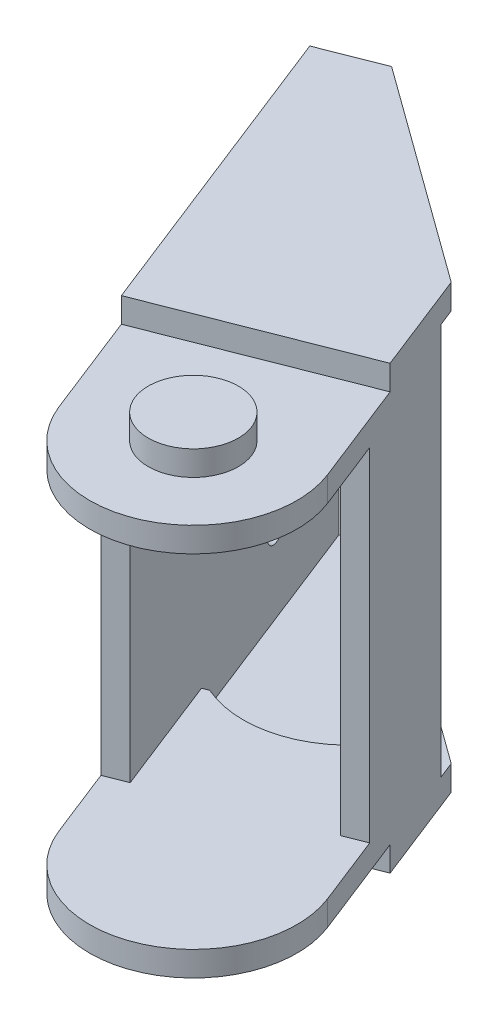
ISO-10303-21;
HEADER;
FILE_DESCRIPTION(('STEP AP214'),'2;1');
FILE_NAME('part.step','',(''),(''),'','','');
FILE_SCHEMA(('AUTOMOTIVE_DESIGN { 1 0 10303 214 1 1 1 1 }'));
ENDSEC;
DATA;
#1=APPLICATION_CONTEXT('core data for automotive mechanical design processes');
#2=APPLICATION_PROTOCOL_DEFINITION('international standard','automotive_design',2000,#1);
#3=PRODUCT_CONTEXT('',#1,'mechanical');
#4=PRODUCT('Part','Part','',(#3));
#5=PRODUCT_RELATED_PRODUCT_CATEGORY('part','',(#4));
#6=PRODUCT_DEFINITION_FORMATION('','',#4);
#7=PRODUCT_DEFINITION_CONTEXT('part definition',#1,'design');
#8=PRODUCT_DEFINITION('design','',#6,#7);
#9=PRODUCT_DEFINITION_SHAPE('','',#8);
#10=(LENGTH_UNIT() NAMED_UNIT(*) SI_UNIT(.MILLI.,.METRE.));
#11=(NAMED_UNIT(*) PLANE_ANGLE_UNIT() SI_UNIT($,.RADIAN.));
#12=(NAMED_UNIT(*) SI_UNIT($,.STERADIAN.) SOLID_ANGLE_UNIT());
#13=UNCERTAINTY_MEASURE_WITH_UNIT(LENGTH_MEASURE(1.E-05),#10,'distance_accuracy_value','');
#14=(GEOMETRIC_REPRESENTATION_CONTEXT(3) GLOBAL_UNCERTAINTY_ASSIGNED_CONTEXT((#13)) GLOBAL_UNIT_ASSIGNED_CONTEXT((#10,
#11,#12)) REPRESENTATION_CONTEXT('',''));
#15=CARTESIAN_POINT('',(0.,0.,0.));
#16=DIRECTION('',(0.,0.,1.));
#17=DIRECTION('',(1.,0.,0.));
#18=AXIS2_PLACEMENT_3D('',#15,#16,#17);
#19=CARTESIAN_POINT('',(-11.9490681605092,0.,-30.4158112478024));
#20=DIRECTION('',(-0.365652358002225,0.,-0.930751499105649));
#21=DIRECTION('',(-0.930751499105649,0.,0.365652358002225));
#22=AXIS2_PLACEMENT_3D('',#19,#20,#21);
#23=PLANE('',#22);
#24=DIRECTION('',(0.,1.,0.));
#25=VECTOR('',#24,1.);
#26=CARTESIAN_POINT('',(-177.240912986167,40.7499999999999,34.5202676917591));
#27=LINE('',#26,#25);
#28=CARTESIAN_POINT('',(-177.240912986167,38.0000000000003,34.5202676917591));
#29=VERTEX_POINT('',#28);
#30=CARTESIAN_POINT('',(-177.240912986167,40.75,34.5202676917591));
#31=VERTEX_POINT('',#30);
#32=EDGE_CURVE('E1367',#29,#31,#27,.T.);
#33=ORIENTED_EDGE('',*,*,#32,.T.);
#34=DIRECTION('',(0.930751499105649,0.,-0.365652358002225));
#35=VECTOR('',#34,1.);
#36=CARTESIAN_POINT('',(-179.567791733931,40.75,35.4343985867648));
#37=LINE('',#36,#35);
#38=CARTESIAN_POINT('',(-176.585881805809,40.75,34.2629340254766));
#39=VERTEX_POINT('',#38);
#40=EDGE_CURVE('E236',#31,#39,#37,.T.);
#41=ORIENTED_EDGE('',*,*,#40,.T.);
#42=DIRECTION('',(0.,1.,0.));
#43=VECTOR('',#42,1.);
#44=CARTESIAN_POINT('',(-176.585881805809,38.,34.2629340254768));
#45=LINE('',#44,#43);
#46=CARTESIAN_POINT('',(-176.585881805809,38.0000000000003,34.2629340254769));
#47=VERTEX_POINT('',#46);
#48=EDGE_CURVE('E380',#47,#39,#45,.T.);
#49=ORIENTED_EDGE('',*,*,#48,.F.);
#50=DIRECTION('',(0.930751499105649,0.,-0.365652358002225));
#51=VECTOR('',#50,1.);
#52=CARTESIAN_POINT('',(-177.240912986167,38.0000000000003,34.5202676917593));
#53=LINE('',#52,#51);
#54=EDGE_CURVE('E342',#29,#47,#53,.T.);
#55=ORIENTED_EDGE('',*,*,#54,.F.);
#56=EDGE_LOOP('',(#33,#41,#49,#55));
#57=FACE_BOUND('',#56,.T.);
#58=ADVANCED_FACE('F45',(#57),#23,.T.);
#59=CARTESIAN_POINT('',(-160.72838452886,43.5,51.938617324416));
#60=DIRECTION('',(0.,-1.,0.));
#61=DIRECTION('',(0.,0.,-1.));
#62=AXIS2_PLACEMENT_3D('',#59,#60,#61);
#63=PLANE('',#62);
#64=CARTESIAN_POINT('',(-160.7283845288,43.5,51.9386173245));
#65=DIRECTION('',(0.,1.,0.));
#66=DIRECTION('',(0.,0.,1.));
#67=AXIS2_PLACEMENT_3D('',#64,#65,#66);
#68=CIRCLE('',#67,5.);
#69=CARTESIAN_POINT('',(-160.7283845288,43.5,56.9386173245));
#70=VERTEX_POINT('',#69);
#71=EDGE_CURVE('E273',#70,#70,#68,.T.);
#72=ORIENTED_EDGE('',*,*,#71,.T.);
#73=EDGE_LOOP('',(#72));
#74=FACE_BOUND('',#73,.T.);
#75=ADVANCED_FACE('F1423',(#74),#63,.F.);
#76=CARTESIAN_POINT('',(-160.72838452882,-5.5,51.9386173243801));
#77=DIRECTION('',(0.,1.,0.));
#78=DIRECTION('',(0.,0.,1.));
#79=AXIS2_PLACEMENT_3D('',#76,#77,#78);
#80=PLANE('',#79);
#81=DIRECTION('',(-0.365652358000698,0.,-0.930751499106249));
#82=VECTOR('',#81,1.);
#83=CARTESIAN_POINT('',(-182.58442368746,-5.5,27.7556987188424));
#84=LINE('',#83,#82);
#85=CARTESIAN_POINT('',(-175.911268153856,-5.5,44.7419135777648));
#86=VERTEX_POINT('',#85);
#87=CARTESIAN_POINT('',(-189.440405399938,-5.5,10.3041081108558));
#88=VERTEX_POINT('',#87);
#89=EDGE_CURVE('E317',#86,#88,#84,.T.);
#90=ORIENTED_EDGE('',*,*,#89,.T.);
#91=DIRECTION('',(0.930751499105648,0.,-0.365652358002227));
#92=VECTOR('',#91,1.);
#93=CARTESIAN_POINT('',(-189.440405399938,-5.5,10.3041081108558));
#94=LINE('',#93,#92);
#95=CARTESIAN_POINT('',(-182.925144906199,-5.5,7.74454160484019));
#96=VERTEX_POINT('',#95);
#97=EDGE_CURVE('E243',#88,#96,#94,.T.);
#98=ORIENTED_EDGE('',*,*,#97,.T.);
#99=DIRECTION('',(0.809703559773043,0.,0.586839113634105));
#100=VECTOR('',#99,1.);
#101=CARTESIAN_POINT('',(-182.925144906199,-5.5,7.74454160484019));
#102=LINE('',#101,#100);
#103=CARTESIAN_POINT('',(-158.891811970518,-5.5,25.1628913544714));
#104=VERTEX_POINT('',#103);
#105=EDGE_CURVE('E246',#96,#104,#102,.T.);
#106=ORIENTED_EDGE('',*,*,#105,.T.);
#107=DIRECTION('',(0.365652358002226,0.,0.930751499105648));
#108=VECTOR('',#107,1.);
#109=CARTESIAN_POINT('',(-150.024742289129,-5.5,47.7336152073636));
#110=LINE('',#109,#108);
#111=CARTESIAN_POINT('',(-154.503983674491,-5.5,36.3319093437392));
#112=VERTEX_POINT('',#111);
#113=EDGE_CURVE('E319',#104,#112,#110,.T.);
#114=ORIENTED_EDGE('',*,*,#113,.T.);
#115=DIRECTION('',(-0.930751499105649,0.,0.365652358002226));
#116=VECTOR('',#115,1.);
#117=CARTESIAN_POINT('',(-165.207625914183,-5.5,40.5369114607557));
#118=LINE('',#117,#116);
#119=EDGE_CURVE('E53',#112,#86,#118,.T.);
#120=ORIENTED_EDGE('',*,*,#119,.T.);
#121=EDGE_LOOP('',(#90,#98,#106,#114,#120));
#122=FACE_BOUND('',#121,.T.);
#123=ADVANCED_FACE('F1332',(#122),#80,.F.);
#124=CARTESIAN_POINT('',(-177.240912986167,-2.75,34.520267691759));
#125=VERTEX_POINT('',#124);
#126=CARTESIAN_POINT('',(-177.240912986167,2.77555756156289E-13,34.5202676917591));
#127=VERTEX_POINT('',#126);
#128=EDGE_CURVE('E1365',#125,#127,#27,.T.);
#129=ORIENTED_EDGE('',*,*,#128,.T.);
#130=DIRECTION('',(0.930751499105649,0.,-0.365652358002226));
#131=VECTOR('',#130,1.);
#132=CARTESIAN_POINT('',(-176.585881805809,0.,34.2629340254767));
#133=LINE('',#132,#131);
#134=CARTESIAN_POINT('',(-176.585881805809,0.,34.2629340254768));
#135=VERTEX_POINT('',#134);
#136=EDGE_CURVE('E371',#127,#135,#133,.T.);
#137=ORIENTED_EDGE('',*,*,#136,.T.);
#138=DIRECTION('',(0.,1.,0.));
#139=VECTOR('',#138,1.);
#140=CARTESIAN_POINT('',(-176.585881805809,-2.75,34.2629340254768));
#141=LINE('',#140,#139);
#142=CARTESIAN_POINT('',(-176.585881805809,-2.75,34.2629340254768));
#143=VERTEX_POINT('',#142);
#144=EDGE_CURVE('E312',#143,#135,#141,.T.);
#145=ORIENTED_EDGE('',*,*,#144,.F.);
#146=DIRECTION('',(-0.930751499105649,0.,0.365652358002225));
#147=VECTOR('',#146,1.);
#148=CARTESIAN_POINT('',(-158.160507254501,-2.75,27.0243943527135));
#149=LINE('',#148,#147);
#150=EDGE_CURVE('E383',#143,#125,#149,.T.);
#151=ORIENTED_EDGE('',*,*,#150,.T.);
#152=EDGE_LOOP('',(#129,#137,#145,#151));
#153=FACE_BOUND('',#152,.T.);
#154=ADVANCED_FACE('F1426',(#153),#23,.T.);
#155=CARTESIAN_POINT('',(-6.82993515371631,0.,-17.3852902704244));
#156=DIRECTION('',(0.365652358061123,0.,0.93075149908251));
#157=DIRECTION('',(0.93075149908251,0.,-0.365652358061123));
#158=AXIS2_PLACEMENT_3D('',#155,#156,#157);
#159=PLANE('',#158);
#160=DIRECTION('',(-0.93075149908251,0.,0.365652358061123));
#161=VECTOR('',#160,1.);
#162=CARTESIAN_POINT('',(-153.041374243652,38.,40.0549153391781));
#163=LINE('',#162,#161);
#164=CARTESIAN_POINT('',(-153.041374243652,38.,40.0549153391781));
#165=VERTEX_POINT('',#164);
#166=CARTESIAN_POINT('',(-155.368252990242,38.0000000000002,40.9690462351789));
#167=VERTEX_POINT('',#166);
#168=EDGE_CURVE('E360',#165,#167,#163,.T.);
#169=ORIENTED_EDGE('',*,*,#168,.T.);
#170=DIRECTION('',(0.,1.,0.));
#171=VECTOR('',#170,1.);
#172=CARTESIAN_POINT('',(-155.368252990242,2.51062781034005E-13,40.9690462351788));
#173=LINE('',#172,#171);
#174=CARTESIAN_POINT('',(-155.36825299068,0.,40.9690462340644));
#175=VERTEX_POINT('',#174);
#176=EDGE_CURVE('E330',#175,#167,#173,.T.);
#177=ORIENTED_EDGE('',*,*,#176,.F.);
#178=DIRECTION('',(0.93075149908251,0.,-0.365652358061123));
#179=VECTOR('',#178,1.);
#180=CARTESIAN_POINT('',(-156.023284171507,0.,41.2263799005793));
#181=LINE('',#180,#179);
#182=CARTESIAN_POINT('',(-153.041374243652,0.,40.0549153391781));
#183=VERTEX_POINT('',#182);
#184=EDGE_CURVE('E363',#175,#183,#181,.T.);
#185=ORIENTED_EDGE('',*,*,#184,.T.);
#186=DIRECTION('',(0.,1.,0.));
#187=VECTOR('',#186,1.);
#188=CARTESIAN_POINT('',(-153.041374243652,0.,40.0549153391781));
#189=LINE('',#188,#187);
#190=EDGE_CURVE('E355',#183,#165,#189,.T.);
#191=ORIENTED_EDGE('',*,*,#190,.T.);
#192=EDGE_LOOP('',(#169,#177,#185,#191));
#193=FACE_BOUND('',#192,.T.);
#194=ADVANCED_FACE('F1435',(#193),#159,.T.);
#195=CARTESIAN_POINT('',(-6.82993515375245,0.,-17.3852902705165));
#196=DIRECTION('',(0.36565235806112,0.,0.930751499082512));
#197=DIRECTION('',(0.930751499082512,0.,-0.36565235806112));
#198=AXIS2_PLACEMENT_3D('',#195,#196,#197);
#199=PLANE('',#198);
#200=DIRECTION('',(0.930751499082512,0.,-0.36565235806112));
#201=VECTOR('',#200,1.);
#202=CARTESIAN_POINT('',(-174.448658722586,0.,48.4649195744912));
#203=LINE('',#202,#201);
#204=CARTESIAN_POINT('',(-174.448658722586,0.,48.4649195744912));
#205=VERTEX_POINT('',#204);
#206=CARTESIAN_POINT('',(-172.121779974143,2.74925928360181E-13,47.550788679219));
#207=VERTEX_POINT('',#206);
#208=EDGE_CURVE('E347',#205,#207,#203,.T.);
#209=ORIENTED_EDGE('',*,*,#208,.T.);
#210=DIRECTION('',(0.,-1.,0.));
#211=VECTOR('',#210,1.);
#212=CARTESIAN_POINT('',(-172.121779974143,38.0000000000003,47.550788679219));
#213=LINE('',#212,#211);
#214=CARTESIAN_POINT('',(-172.121779974201,38.,47.5507886790717));
#215=VERTEX_POINT('',#214);
#216=EDGE_CURVE('E339',#215,#207,#213,.T.);
#217=ORIENTED_EDGE('',*,*,#216,.F.);
#218=DIRECTION('',(-0.930751499082512,0.,0.36565235806112));
#219=VECTOR('',#218,1.);
#220=CARTESIAN_POINT('',(-171.466748794345,38.,47.2934550129388));
#221=LINE('',#220,#219);
#222=CARTESIAN_POINT('',(-174.448658722586,38.,48.4649195744912));
#223=VERTEX_POINT('',#222);
#224=EDGE_CURVE('E350',#215,#223,#221,.T.);
#225=ORIENTED_EDGE('',*,*,#224,.T.);
#226=DIRECTION('',(0.,-1.,0.));
#227=VECTOR('',#226,1.);
#228=CARTESIAN_POINT('',(-174.448658722586,38.,48.4649195744912));
#229=LINE('',#228,#227);
#230=EDGE_CURVE('E344',#223,#205,#229,.T.);
#231=ORIENTED_EDGE('',*,*,#230,.T.);
#232=EDGE_LOOP('',(#209,#217,#225,#231));
#233=FACE_BOUND('',#232,.T.);
#234=ADVANCED_FACE('F1438',(#233),#199,.T.);
#235=DIRECTION('',(0.,1.,0.));
#236=VECTOR('',#235,1.);
#237=CARTESIAN_POINT('',(-161.142417182623,-2.75,28.1958589140017));
#238=LINE('',#237,#236);
#239=CARTESIAN_POINT('',(-161.142417182623,-2.75,28.1958589140016));
#240=VERTEX_POINT('',#239);
#241=CARTESIAN_POINT('',(-161.142417182623,0.,28.1958589140017));
#242=VERTEX_POINT('',#241);
#243=EDGE_CURVE('E310',#240,#242,#238,.T.);
#244=ORIENTED_EDGE('',*,*,#243,.T.);
#245=CARTESIAN_POINT('',(-160.487386002265,2.51062781034004E-13,27.9385252477194));
#246=VERTEX_POINT('',#245);
#247=EDGE_CURVE('E369',#242,#246,#133,.T.);
#248=ORIENTED_EDGE('',*,*,#247,.T.);
#249=DIRECTION('',(0.,-1.,0.));
#250=VECTOR('',#249,1.);
#251=CARTESIAN_POINT('',(-160.487386002265,38.0000000000002,27.9385252477194));
#252=LINE('',#251,#250);
#253=CARTESIAN_POINT('',(-160.487386002265,38.0000000000002,27.9385252477194));
#254=VERTEX_POINT('',#253);
#255=EDGE_CURVE('E325',#254,#246,#252,.T.);
#256=ORIENTED_EDGE('',*,*,#255,.F.);
#257=DIRECTION('',(-0.930751499105649,0.,0.365652358002225));
#258=VECTOR('',#257,1.);
#259=CARTESIAN_POINT('',(-160.487386002265,38.0000000000002,27.9385252477194));
#260=LINE('',#259,#258);
#261=CARTESIAN_POINT('',(-161.142417182623,38.0000000000002,28.1958589140019));
#262=VERTEX_POINT('',#261);
#263=EDGE_CURVE('E333',#254,#262,#260,.T.);
#264=ORIENTED_EDGE('',*,*,#263,.T.);
#265=DIRECTION('',(0.,1.,0.));
#266=VECTOR('',#265,1.);
#267=CARTESIAN_POINT('',(-161.142417182623,38.,28.1958589140015));
#268=LINE('',#267,#266);
#269=CARTESIAN_POINT('',(-161.142417182623,40.75,28.1958589140015));
#270=VERTEX_POINT('',#269);
#271=EDGE_CURVE('E378',#262,#270,#268,.T.);
#272=ORIENTED_EDGE('',*,*,#271,.T.);
#273=CARTESIAN_POINT('',(-158.160507254501,40.75,27.0243943527135));
#274=VERTEX_POINT('',#273);
#275=EDGE_CURVE('E389',#270,#274,#37,.T.);
#276=ORIENTED_EDGE('',*,*,#275,.T.);
#277=DIRECTION('',(0.,-1.,0.));
#278=VECTOR('',#277,1.);
#279=CARTESIAN_POINT('',(-158.160507254501,40.75,27.0243943527135));
#280=LINE('',#279,#278);
#281=CARTESIAN_POINT('',(-158.160507254501,-2.75,27.0243943527136));
#282=VERTEX_POINT('',#281);
#283=EDGE_CURVE('E391',#274,#282,#280,.T.);
#284=ORIENTED_EDGE('',*,*,#283,.T.);
#285=EDGE_CURVE('E386',#282,#240,#149,.T.);
#286=ORIENTED_EDGE('',*,*,#285,.T.);
#287=EDGE_LOOP('',(#244,#248,#256,#264,#272,#276,#284,#286));
#288=FACE_BOUND('',#287,.T.);
#289=ADVANCED_FACE('F1355',(#288),#23,.T.);
#290=CARTESIAN_POINT('',(-164.933386645826,38.,41.234975084785));
#291=DIRECTION('',(0.,1.,0.));
#292=DIRECTION('',(1.,0.,0.));
#293=AXIS2_PLACEMENT_3D('',#290,#291,#292);
#294=PLANE('',#293);
#295=CARTESIAN_POINT('',(-160.72838452893,38.,51.9386173244435));
#296=DIRECTION('',(0.,1.,0.));
#297=DIRECTION('',(0.365652358010348,0.,0.930751499102458));
#298=AXIS2_PLACEMENT_3D('',#295,#296,#297);
#299=CIRCLE('',#298,11.5);
#300=CARTESIAN_POINT('',(-171.432026768707,38.,56.1436194416015));
#301=VERTEX_POINT('',#300);
#302=CARTESIAN_POINT('',(-150.02474228981,38.,47.7336152061957));
#303=VERTEX_POINT('',#302);
#304=EDGE_CURVE('E415',#301,#303,#299,.T.);
#305=ORIENTED_EDGE('',*,*,#304,.F.);
#306=DIRECTION('',(0.365652358061124,0.,0.93075149908251));
#307=VECTOR('',#306,1.);
#308=CARTESIAN_POINT('',(-174.448658722586,38.,48.4649195744912));
#309=LINE('',#308,#307);
#310=EDGE_CURVE('E353',#223,#301,#309,.T.);
#311=ORIENTED_EDGE('',*,*,#310,.F.);
#312=ORIENTED_EDGE('',*,*,#224,.F.);
#313=DIRECTION('',(0.365652358002226,0.,0.930751499105649));
#314=VECTOR('',#313,1.);
#315=CARTESIAN_POINT('',(-177.240912986167,38.0000000000003,34.5202676917593));
#316=LINE('',#315,#314);
#317=EDGE_CURVE('E337',#29,#215,#316,.T.);
#318=ORIENTED_EDGE('',*,*,#317,.F.);
#319=ORIENTED_EDGE('',*,*,#54,.T.);
#320=CARTESIAN_POINT('',(-171.880781447868,38.,23.5506966017777));
#321=DIRECTION('',(0.,1.,0.));
#322=DIRECTION('',(0.,0.,1.));
#323=AXIS2_PLACEMENT_3D('',#320,#321,#322);
#324=CIRCLE('',#323,11.6999999999998);
#325=EDGE_CURVE('E375',#47,#262,#324,.T.);
#326=ORIENTED_EDGE('',*,*,#325,.T.);
#327=ORIENTED_EDGE('',*,*,#263,.F.);
#328=DIRECTION('',(-0.365652358002224,0.,-0.930751499105649));
#329=VECTOR('',#328,1.);
#330=CARTESIAN_POINT('',(-155.368252990242,38.0000000000002,40.9690462351789));
#331=LINE('',#330,#329);
#332=EDGE_CURVE('E321',#167,#254,#331,.T.);
#333=ORIENTED_EDGE('',*,*,#332,.F.);
#334=ORIENTED_EDGE('',*,*,#168,.F.);
#335=DIRECTION('',(0.365652358061124,0.,0.93075149908251));
#336=VECTOR('',#335,1.);
#337=CARTESIAN_POINT('',(-153.041374243652,38.,40.0549153391781));
#338=LINE('',#337,#336);
#339=EDGE_CURVE('E365',#165,#303,#338,.T.);
#340=ORIENTED_EDGE('',*,*,#339,.T.);
#341=EDGE_LOOP('',(#305,#311,#312,#318,#319,#326,#327,#333,#334,#340));
#342=FACE_BOUND('',#341,.T.);
#343=ADVANCED_FACE('F1394',(#342),#294,.F.);
#344=CARTESIAN_POINT('',(-177.008225228049,-5.5,41.9496590801645));
#345=DIRECTION('',(-0.930751499105649,0.,0.365652358002226));
#346=DIRECTION('',(0.,1.,0.));
#347=AXIS2_PLACEMENT_3D('',#344,#345,#346);
#348=PLANE('',#347);
#349=CARTESIAN_POINT('',(-184.961164014476,31.5,21.7058139749256));
#350=DIRECTION('',(-0.930751499105649,0.,0.365652358002226));
#351=DIRECTION('',(0.365652358002226,0.,0.930751499105649));
#352=AXIS2_PLACEMENT_3D('',#349,#350,#351);
#353=CIRCLE('',#352,2.00000000000001);
#354=CARTESIAN_POINT('',(-184.229859298472,31.5,23.5673169731369));
#355=VERTEX_POINT('',#354);
#356=EDGE_CURVE('E1381',#355,#355,#353,.T.);
#357=ORIENTED_EDGE('',*,*,#356,.F.);
#358=EDGE_LOOP('',(#357));
#359=FACE_BOUND('',#358,.T.);
#360=CARTESIAN_POINT('',(-184.961164014476,6.5,21.7058139749256));
#361=DIRECTION('',(-0.930751499105649,0.,0.365652358002226));
#362=DIRECTION('',(0.365652358002226,0.,0.930751499105649));
#363=AXIS2_PLACEMENT_3D('',#360,#361,#362);
#364=CIRCLE('',#363,2.00000000000001);
#365=CARTESIAN_POINT('',(-184.229859298472,6.5,23.5673169731369));
#366=VERTEX_POINT('',#365);
#367=EDGE_CURVE('E1374',#366,#366,#364,.T.);
#368=ORIENTED_EDGE('',*,*,#367,.F.);
#369=EDGE_LOOP('',(#368));
#370=FACE_BOUND('',#369,.T.);
#371=CARTESIAN_POINT('',(-180.390509539448,19.,33.3402077137462));
#372=DIRECTION('',(-0.930751499105649,0.,0.365652358002226));
#373=DIRECTION('',(0.365652358002226,0.,0.930751499105649));
#374=AXIS2_PLACEMENT_3D('',#371,#372,#373);
#375=CIRCLE('',#374,2.);
#376=CARTESIAN_POINT('',(-179.659204823444,19.,35.2017107119575));
#377=VERTEX_POINT('',#376);
#378=EDGE_CURVE('E1375',#377,#377,#375,.T.);
#379=ORIENTED_EDGE('',*,*,#378,.F.);
#380=EDGE_LOOP('',(#379));
#381=FACE_BOUND('',#380,.T.);
#382=DIRECTION('',(0.365652357999172,0.,0.930751499106848));
#383=VECTOR('',#382,1.);
#384=CARTESIAN_POINT('',(-171.432026768565,43.5,56.1436194413973));
#385=LINE('',#384,#383);
#386=CARTESIAN_POINT('',(-189.440405399938,43.5,10.3041081108558));
#387=VERTEX_POINT('',#386);
#388=CARTESIAN_POINT('',(-175.911268153884,43.5,44.7419135777757));
#389=VERTEX_POINT('',#388);
#390=EDGE_CURVE('E407',#387,#389,#385,.T.);
#391=ORIENTED_EDGE('',*,*,#390,.F.);
#392=DIRECTION('',(0.,-1.,0.));
#393=VECTOR('',#392,1.);
#394=CARTESIAN_POINT('',(-189.440405399938,37.254005174746,10.3041081108558));
#395=LINE('',#394,#393);
#396=EDGE_CURVE('E254',#387,#88,#395,.T.);
#397=ORIENTED_EDGE('',*,*,#396,.T.);
#398=ORIENTED_EDGE('',*,*,#89,.F.);
#399=DIRECTION('',(0.,-1.,0.));
#400=VECTOR('',#399,1.);
#401=CARTESIAN_POINT('',(-175.911268153921,-5.50000000000002,44.7419135777904));
#402=LINE('',#401,#400);
#403=CARTESIAN_POINT('',(-175.911268153921,-2.75,44.7419135777904));
#404=VERTEX_POINT('',#403);
#405=EDGE_CURVE('E304',#404,#86,#402,.T.);
#406=ORIENTED_EDGE('',*,*,#405,.F.);
#407=DIRECTION('',(-0.365652358002226,0.,-0.930751499105649));
#408=VECTOR('',#407,1.);
#409=CARTESIAN_POINT('',(-177.008225228049,-2.75,41.9496590801645));
#410=LINE('',#409,#408);
#411=CARTESIAN_POINT('',(-171.432026768505,-2.75,56.1436194414142));
#412=VERTEX_POINT('',#411);
#413=EDGE_CURVE('E306',#412,#404,#410,.T.);
#414=ORIENTED_EDGE('',*,*,#413,.F.);
#415=DIRECTION('',(0.,1.,0.));
#416=VECTOR('',#415,1.);
#417=CARTESIAN_POINT('',(-171.432026768498,-2.75,56.1436194414317));
#418=LINE('',#417,#416);
#419=CARTESIAN_POINT('',(-171.432026768707,0.,56.1436194416015));
#420=VERTEX_POINT('',#419);
#421=EDGE_CURVE('E400',#412,#420,#418,.T.);
#422=ORIENTED_EDGE('',*,*,#421,.T.);
#423=DIRECTION('',(0.365652358061124,0.,0.93075149908251));
#424=VECTOR('',#423,1.);
#425=CARTESIAN_POINT('',(-174.448658722586,0.,48.4649195744912));
#426=LINE('',#425,#424);
#427=EDGE_CURVE('E352',#205,#420,#426,.T.);
#428=ORIENTED_EDGE('',*,*,#427,.F.);
#429=ORIENTED_EDGE('',*,*,#230,.F.);
#430=ORIENTED_EDGE('',*,*,#310,.T.);
#431=DIRECTION('',(0.,1.,0.));
#432=VECTOR('',#431,1.);
#433=CARTESIAN_POINT('',(-171.432026768422,-5.5,56.1436194414894));
#434=LINE('',#433,#432);
#435=CARTESIAN_POINT('',(-171.432026768515,40.75,56.143619441526));
#436=VERTEX_POINT('',#435);
#437=EDGE_CURVE('E410',#301,#436,#434,.T.);
#438=ORIENTED_EDGE('',*,*,#437,.T.);
#439=DIRECTION('',(0.365652358002226,0.,0.930751499105649));
#440=VECTOR('',#439,1.);
#441=CARTESIAN_POINT('',(-177.008225228049,40.75,41.9496590801645));
#442=LINE('',#441,#440);
#443=CARTESIAN_POINT('',(-175.911268153921,40.75,44.7419135777904));
#444=VERTEX_POINT('',#443);
#445=EDGE_CURVE('E293',#444,#436,#442,.T.);
#446=ORIENTED_EDGE('',*,*,#445,.F.);
#447=DIRECTION('',(0.,-1.,0.));
#448=VECTOR('',#447,1.);
#449=CARTESIAN_POINT('',(-175.911268153921,-5.5,44.7419135777904));
#450=LINE('',#449,#448);
#451=EDGE_CURVE('E291',#389,#444,#450,.T.);
#452=ORIENTED_EDGE('',*,*,#451,.F.);
#453=EDGE_LOOP('',(#391,#397,#398,#406,#414,#422,#428,#429,#430,#438,#446,#452));
#454=FACE_BOUND('',#453,.T.);
#455=ADVANCED_FACE('F47',(#359,#370,#381,#454),#348,.T.);
#456=CARTESIAN_POINT('',(-155.600940748619,-5.5,33.5396548461134));
#457=DIRECTION('',(0.930751499105649,0.,-0.365652358002226));
#458=DIRECTION('',(0.,-1.,0.));
#459=AXIS2_PLACEMENT_3D('',#456,#457,#458);
#460=PLANE('',#459);
#461=DIRECTION('',(0.,-1.,0.));
#462=VECTOR('',#461,1.);
#463=CARTESIAN_POINT('',(-158.891811970518,82.9361499624534,25.1628913544714));
#464=LINE('',#463,#462);
#465=CARTESIAN_POINT('',(-158.891811970518,43.5,25.1628913544714));
#466=VERTEX_POINT('',#465);
#467=CARTESIAN_POINT('',(-158.891811970518,40.75,25.1628913544714));
#468=VERTEX_POINT('',#467);
#469=EDGE_CURVE('E266',#466,#468,#464,.T.);
#470=ORIENTED_EDGE('',*,*,#469,.F.);
#471=DIRECTION('',(-0.3656523580007,0.,-0.930751499106248));
#472=VECTOR('',#471,1.);
#473=CARTESIAN_POINT('',(-161.177139208116,43.5,19.3456944848454));
#474=LINE('',#473,#472);
#475=CARTESIAN_POINT('',(-154.503983674519,43.5,36.3319093437501));
#476=VERTEX_POINT('',#475);
#477=EDGE_CURVE('E404',#476,#466,#474,.T.);
#478=ORIENTED_EDGE('',*,*,#477,.F.);
#479=DIRECTION('',(0.,1.,0.));
#480=VECTOR('',#479,1.);
#481=CARTESIAN_POINT('',(-154.503983674491,40.75,36.3319093437392));
#482=LINE('',#481,#480);
#483=CARTESIAN_POINT('',(-154.503983674491,40.75,36.3319093437392));
#484=VERTEX_POINT('',#483);
#485=EDGE_CURVE('E60',#484,#476,#482,.T.);
#486=ORIENTED_EDGE('',*,*,#485,.F.);
#487=DIRECTION('',(-0.365652358002225,0.,-0.930751499105649));
#488=VECTOR('',#487,1.);
#489=CARTESIAN_POINT('',(-150.024742289085,40.75,47.7336152074748));
#490=LINE('',#489,#488);
#491=CARTESIAN_POINT('',(-150.024742289132,40.75,47.733615207493));
#492=VERTEX_POINT('',#491);
#493=EDGE_CURVE('E285',#492,#484,#490,.T.);
#494=ORIENTED_EDGE('',*,*,#493,.F.);
#495=DIRECTION('',(0.,1.,0.));
#496=VECTOR('',#495,1.);
#497=CARTESIAN_POINT('',(-150.024742289178,-5.5,47.7336152075113));
#498=LINE('',#497,#496);
#499=EDGE_CURVE('E409',#303,#492,#498,.T.);
#500=ORIENTED_EDGE('',*,*,#499,.F.);
#501=ORIENTED_EDGE('',*,*,#339,.F.);
#502=ORIENTED_EDGE('',*,*,#190,.F.);
#503=DIRECTION('',(0.365652358061124,0.,0.93075149908251));
#504=VECTOR('',#503,1.);
#505=CARTESIAN_POINT('',(-153.041374243652,0.,40.0549153391781));
#506=LINE('',#505,#504);
#507=CARTESIAN_POINT('',(-150.02474228981,0.,47.7336152061957));
#508=VERTEX_POINT('',#507);
#509=EDGE_CURVE('E366',#183,#508,#506,.T.);
#510=ORIENTED_EDGE('',*,*,#509,.T.);
#511=DIRECTION('',(0.,1.,0.));
#512=VECTOR('',#511,1.);
#513=CARTESIAN_POINT('',(-150.024742289222,-2.75,47.7336152074002));
#514=LINE('',#513,#512);
#515=CARTESIAN_POINT('',(-150.024742289129,-2.75,47.7336152073839));
#516=VERTEX_POINT('',#515);
#517=EDGE_CURVE('E402',#516,#508,#514,.T.);
#518=ORIENTED_EDGE('',*,*,#517,.F.);
#519=DIRECTION('',(0.365652358002225,0.,0.930751499105649));
#520=VECTOR('',#519,1.);
#521=CARTESIAN_POINT('',(-154.503983674491,-2.75,36.3319093437392));
#522=LINE('',#521,#520);
#523=CARTESIAN_POINT('',(-154.503983674491,-2.75,36.3319093437392));
#524=VERTEX_POINT('',#523);
#525=EDGE_CURVE('E299',#524,#516,#522,.T.);
#526=ORIENTED_EDGE('',*,*,#525,.F.);
#527=DIRECTION('',(0.,1.,0.));
#528=VECTOR('',#527,1.);
#529=CARTESIAN_POINT('',(-154.503983674491,-5.5,36.3319093437392));
#530=LINE('',#529,#528);
#531=EDGE_CURVE('E296',#112,#524,#530,.T.);
#532=ORIENTED_EDGE('',*,*,#531,.F.);
#533=ORIENTED_EDGE('',*,*,#113,.F.);
#534=CARTESIAN_POINT('',(-158.891811970518,-2.75,25.1628913544714));
#535=VERTEX_POINT('',#534);
#536=EDGE_CURVE('E259',#535,#104,#464,.T.);
#537=ORIENTED_EDGE('',*,*,#536,.F.);
#538=DIRECTION('',(0.365652358002226,0.,0.930751499105648));
#539=VECTOR('',#538,1.);
#540=CARTESIAN_POINT('',(-150.024742289129,-2.75,47.7336152073636));
#541=LINE('',#540,#539);
#542=EDGE_CURVE('E314',#535,#282,#541,.T.);
#543=ORIENTED_EDGE('',*,*,#542,.T.);
#544=ORIENTED_EDGE('',*,*,#283,.F.);
#545=DIRECTION('',(-0.365652358002225,0.,-0.930751499105649));
#546=VECTOR('',#545,1.);
#547=CARTESIAN_POINT('',(-158.160507254501,40.75,27.0243943527135));
#548=LINE('',#547,#546);
#549=EDGE_CURVE('E394',#274,#468,#548,.T.);
#550=ORIENTED_EDGE('',*,*,#549,.T.);
#551=EDGE_LOOP('',(#470,#478,#486,#494,#500,#501,#502,#510,#518,#526,#532,#533,#537,#543,#544,#550));
#552=FACE_BOUND('',#551,.T.);
#553=ADVANCED_FACE('F1351',(#552),#460,.T.);
#554=CARTESIAN_POINT('',(-160.72838452893,-5.5,51.9386173244435));
#555=DIRECTION('',(0.,1.,0.));
#556=DIRECTION('',(0.365652358010348,0.,0.930751499102458));
#557=AXIS2_PLACEMENT_3D('',#554,#555,#556);
#558=CYLINDRICAL_SURFACE('',#557,11.5);
#559=CARTESIAN_POINT('',(-160.72838452886,40.75,51.938617324416));
#560=DIRECTION('',(0.,-1.,0.));
#561=DIRECTION('',(0.,0.,-1.));
#562=AXIS2_PLACEMENT_3D('',#559,#560,#561);
#563=CIRCLE('',#562,11.499999999975);
#564=EDGE_CURVE('E269',#436,#492,#563,.F.);
#565=ORIENTED_EDGE('',*,*,#564,.F.);
#566=ORIENTED_EDGE('',*,*,#437,.F.);
#567=ORIENTED_EDGE('',*,*,#304,.T.);
#568=ORIENTED_EDGE('',*,*,#499,.T.);
#569=EDGE_LOOP('',(#565,#566,#567,#568));
#570=FACE_BOUND('',#569,.T.);
#571=ADVANCED_FACE('F1478',(#570),#558,.T.);
#572=CARTESIAN_POINT('',(-160.72838452886,40.75,51.938617324416));
#573=DIRECTION('',(0.,-1.,0.));
#574=DIRECTION('',(0.,0.,-1.));
#575=AXIS2_PLACEMENT_3D('',#572,#573,#574);
#576=PLANE('',#575);
#577=DIRECTION('',(-0.365652358002224,0.,-0.930751499105649));
#578=VECTOR('',#577,1.);
#579=CARTESIAN_POINT('',(-177.240912986167,40.75,34.520267691759));
#580=LINE('',#579,#578);
#581=CARTESIAN_POINT('',(-187.113526652239,40.75,9.38997721587569));
#582=VERTEX_POINT('',#581);
#583=EDGE_CURVE('E222',#31,#582,#580,.T.);
#584=ORIENTED_EDGE('',*,*,#583,.T.);
#585=DIRECTION('',(-0.930751499105648,0.,0.365652358002227));
#586=VECTOR('',#585,1.);
#587=CARTESIAN_POINT('',(-189.440405399938,40.75,10.3041081108558));
#588=LINE('',#587,#586);
#589=CARTESIAN_POINT('',(-182.925144906199,40.75,7.74454160484019));
#590=VERTEX_POINT('',#589);
#591=EDGE_CURVE('E233',#590,#582,#588,.T.);
#592=ORIENTED_EDGE('',*,*,#591,.F.);
#593=DIRECTION('',(-0.809703559773043,0.,-0.586839113634105));
#594=VECTOR('',#593,1.);
#595=CARTESIAN_POINT('',(-182.925144906199,40.75,7.74454160484019));
#596=LINE('',#595,#594);
#597=EDGE_CURVE('E248',#468,#590,#596,.T.);
#598=ORIENTED_EDGE('',*,*,#597,.F.);
#599=ORIENTED_EDGE('',*,*,#549,.F.);
#600=ORIENTED_EDGE('',*,*,#275,.F.);
#601=CARTESIAN_POINT('',(-171.880781447868,40.75,23.5506966017777));
#602=DIRECTION('',(0.,1.,0.));
#603=DIRECTION('',(0.,0.,1.));
#604=AXIS2_PLACEMENT_3D('',#601,#602,#603);
#605=CIRCLE('',#604,11.6999999999998);
#606=EDGE_CURVE('E374',#39,#270,#605,.T.);
#607=ORIENTED_EDGE('',*,*,#606,.F.);
#608=ORIENTED_EDGE('',*,*,#40,.F.);
#609=EDGE_LOOP('',(#584,#592,#598,#599,#600,#607,#608));
#610=FACE_BOUND('',#609,.T.);
#611=ADVANCED_FACE('F232',(#610),#576,.T.);
#612=ORIENTED_EDGE('',*,*,#477,.T.);
#613=DIRECTION('',(-0.809703559773043,0.,-0.586839113634105));
#614=VECTOR('',#613,1.);
#615=CARTESIAN_POINT('',(-182.925144906199,43.5,7.74454160484019));
#616=LINE('',#615,#614);
#617=CARTESIAN_POINT('',(-182.925144906199,43.5,7.74454160484019));
#618=VERTEX_POINT('',#617);
#619=EDGE_CURVE('E1363',#466,#618,#616,.T.);
#620=ORIENTED_EDGE('',*,*,#619,.T.);
#621=DIRECTION('',(-0.930751499105648,0.,0.365652358002227));
#622=VECTOR('',#621,1.);
#623=CARTESIAN_POINT('',(-189.440405399938,43.5,10.3041081108558));
#624=LINE('',#623,#622);
#625=EDGE_CURVE('E1360',#618,#387,#624,.T.);
#626=ORIENTED_EDGE('',*,*,#625,.T.);
#627=ORIENTED_EDGE('',*,*,#390,.T.);
#628=DIRECTION('',(0.930751499105649,0.,-0.365652358002226));
#629=VECTOR('',#628,1.);
#630=CARTESIAN_POINT('',(-165.207625914229,43.5,40.5369114607739));
#631=LINE('',#630,#629);
#632=EDGE_CURVE('E12',#389,#476,#631,.T.);
#633=ORIENTED_EDGE('',*,*,#632,.T.);
#634=EDGE_LOOP('',(#612,#620,#626,#627,#633));
#635=FACE_BOUND('',#634,.T.);
#636=ADVANCED_FACE('F1432',(#635),#63,.F.);
#637=CARTESIAN_POINT('',(-160.72838452886,-2.75,51.938617324416));
#638=DIRECTION('',(0.,1.,0.));
#639=DIRECTION('',(0.,0.,1.));
#640=AXIS2_PLACEMENT_3D('',#637,#638,#639);
#641=CYLINDRICAL_SURFACE('',#640,11.4999999999251);
#642=ORIENTED_EDGE('',*,*,#421,.F.);
#643=CARTESIAN_POINT('',(-160.72838452882,-2.75,51.9386173243801));
#644=DIRECTION('',(0.,1.,0.));
#645=DIRECTION('',(0.,0.,1.));
#646=AXIS2_PLACEMENT_3D('',#643,#644,#645);
#647=CIRCLE('',#646,11.499999999975);
#648=EDGE_CURVE('E271',#516,#412,#647,.F.);
#649=ORIENTED_EDGE('',*,*,#648,.F.);
#650=ORIENTED_EDGE('',*,*,#517,.T.);
#651=CARTESIAN_POINT('',(-160.72838452886,0.,51.938617324416));
#652=DIRECTION('',(0.,-1.,0.));
#653=DIRECTION('',(0.,0.,1.));
#654=AXIS2_PLACEMENT_3D('',#651,#652,#653);
#655=CIRCLE('',#654,11.4999999999251);
#656=EDGE_CURVE('E397',#508,#420,#655,.T.);
#657=ORIENTED_EDGE('',*,*,#656,.T.);
#658=EDGE_LOOP('',(#642,#649,#650,#657));
#659=FACE_BOUND('',#658,.T.);
#660=ADVANCED_FACE('F1554',(#659),#641,.T.);
#661=CARTESIAN_POINT('',(-160.72838452886,0.,51.938617324416));
#662=DIRECTION('',(0.,1.,0.));
#663=DIRECTION('',(0.,0.,1.));
#664=AXIS2_PLACEMENT_3D('',#661,#662,#663);
#665=PLANE('',#664);
#666=CARTESIAN_POINT('',(-171.880781447868,0.,23.5506966017777));
#667=DIRECTION('',(0.,1.,0.));
#668=DIRECTION('',(0.,0.,1.));
#669=AXIS2_PLACEMENT_3D('',#666,#667,#668);
#670=CIRCLE('',#669,11.6999999999999);
#671=EDGE_CURVE('E308',#135,#242,#670,.T.);
#672=ORIENTED_EDGE('',*,*,#671,.F.);
#673=ORIENTED_EDGE('',*,*,#136,.F.);
#674=DIRECTION('',(-0.365652358002224,0.,-0.930751499105649));
#675=VECTOR('',#674,1.);
#676=CARTESIAN_POINT('',(-172.121779974143,2.74925928360181E-13,47.550788679219));
#677=LINE('',#676,#675);
#678=EDGE_CURVE('E335',#207,#127,#677,.T.);
#679=ORIENTED_EDGE('',*,*,#678,.F.);
#680=ORIENTED_EDGE('',*,*,#208,.F.);
#681=ORIENTED_EDGE('',*,*,#427,.T.);
#682=ORIENTED_EDGE('',*,*,#656,.F.);
#683=ORIENTED_EDGE('',*,*,#509,.F.);
#684=ORIENTED_EDGE('',*,*,#184,.F.);
#685=DIRECTION('',(0.365652358002224,0.,0.930751499105649));
#686=VECTOR('',#685,1.);
#687=CARTESIAN_POINT('',(-160.487386002265,2.51062781034004E-13,27.9385252477194));
#688=LINE('',#687,#686);
#689=EDGE_CURVE('E328',#246,#175,#688,.T.);
#690=ORIENTED_EDGE('',*,*,#689,.F.);
#691=ORIENTED_EDGE('',*,*,#247,.F.);
#692=EDGE_LOOP('',(#672,#673,#679,#680,#681,#682,#683,#684,#690,#691));
#693=FACE_BOUND('',#692,.T.);
#694=ADVANCED_FACE('F1417',(#693),#665,.T.);
#695=CARTESIAN_POINT('',(-171.880781447868,38.,23.5506966017777));
#696=DIRECTION('',(0.,1.,0.));
#697=DIRECTION('',(0.,0.,1.));
#698=AXIS2_PLACEMENT_3D('',#695,#696,#697);
#699=CYLINDRICAL_SURFACE('',#698,11.6999999999998);
#700=ORIENTED_EDGE('',*,*,#606,.T.);
#701=ORIENTED_EDGE('',*,*,#271,.F.);
#702=ORIENTED_EDGE('',*,*,#325,.F.);
#703=ORIENTED_EDGE('',*,*,#48,.T.);
#704=EDGE_LOOP('',(#700,#701,#702,#703));
#705=FACE_BOUND('',#704,.T.);
#706=ADVANCED_FACE('F1408',(#705),#699,.F.);
#707=CARTESIAN_POINT('',(-165.291844825657,-2.88756986903428E-13,64.9360789395612));
#708=DIRECTION('',(0.930751499105649,0.,-0.365652358002224));
#709=DIRECTION('',(-0.365652358002224,0.,-0.930751499105649));
#710=AXIS2_PLACEMENT_3D('',#707,#708,#709);
#711=PLANE('',#710);
#712=CARTESIAN_POINT('',(-182.634285266712,31.5,20.7916830799199));
#713=DIRECTION('',(0.930751499105649,0.,-0.365652358002224));
#714=DIRECTION('',(-0.365652358002224,0.,-0.930751499105649));
#715=AXIS2_PLACEMENT_3D('',#712,#713,#714);
#716=CIRCLE('',#715,2.00000000000001);
#717=CARTESIAN_POINT('',(-183.365589982716,31.5,18.9301800817086));
#718=VERTEX_POINT('',#717);
#719=EDGE_CURVE('E237',#718,#718,#716,.F.);
#720=ORIENTED_EDGE('',*,*,#719,.T.);
#721=EDGE_LOOP('',(#720));
#722=FACE_BOUND('',#721,.T.);
#723=CARTESIAN_POINT('',(-182.634285266711,6.5,20.7916830799199));
#724=DIRECTION('',(0.930751499105649,0.,-0.365652358002224));
#725=DIRECTION('',(-0.365652358002224,0.,-0.930751499105649));
#726=AXIS2_PLACEMENT_3D('',#723,#724,#725);
#727=CIRCLE('',#726,2.00000000000001);
#728=CARTESIAN_POINT('',(-183.365589982716,6.5,18.9301800817085));
#729=VERTEX_POINT('',#728);
#730=EDGE_CURVE('E1378',#729,#729,#727,.F.);
#731=ORIENTED_EDGE('',*,*,#730,.T.);
#732=EDGE_LOOP('',(#731));
#733=FACE_BOUND('',#732,.T.);
#734=CARTESIAN_POINT('',(-178.063630791684,19.,32.4260768187405));
#735=DIRECTION('',(0.930751499105649,0.,-0.365652358002224));
#736=DIRECTION('',(-0.365652358002224,0.,-0.930751499105649));
#737=AXIS2_PLACEMENT_3D('',#734,#735,#736);
#738=CIRCLE('',#737,2.);
#739=CARTESIAN_POINT('',(-178.794935507688,19.,30.5645738205292));
#740=VERTEX_POINT('',#739);
#741=EDGE_CURVE('E1371',#740,#740,#738,.F.);
#742=ORIENTED_EDGE('',*,*,#741,.T.);
#743=EDGE_LOOP('',(#742));
#744=FACE_BOUND('',#743,.T.);
#745=ORIENTED_EDGE('',*,*,#678,.T.);
#746=ORIENTED_EDGE('',*,*,#128,.F.);
#747=DIRECTION('',(0.365652358002224,0.,0.930751499105649));
#748=VECTOR('',#747,1.);
#749=CARTESIAN_POINT('',(-177.240912986167,-2.75,34.5202676917589));
#750=LINE('',#749,#748);
#751=CARTESIAN_POINT('',(-187.113526652239,-2.75,9.38997721587566));
#752=VERTEX_POINT('',#751);
#753=EDGE_CURVE('E225',#752,#125,#750,.T.);
#754=ORIENTED_EDGE('',*,*,#753,.F.);
#755=DIRECTION('',(0.,-1.,0.));
#756=VECTOR('',#755,1.);
#757=CARTESIAN_POINT('',(-187.113526652239,40.7499999999999,9.38997721587569));
#758=LINE('',#757,#756);
#759=EDGE_CURVE('E218',#582,#752,#758,.T.);
#760=ORIENTED_EDGE('',*,*,#759,.F.);
#761=ORIENTED_EDGE('',*,*,#583,.F.);
#762=ORIENTED_EDGE('',*,*,#32,.F.);
#763=ORIENTED_EDGE('',*,*,#317,.T.);
#764=ORIENTED_EDGE('',*,*,#216,.T.);
#765=EDGE_LOOP('',(#745,#746,#754,#760,#761,#762,#763,#764));
#766=FACE_BOUND('',#765,.T.);
#767=ADVANCED_FACE('F221',(#722,#733,#744,#766),#711,.T.);
#768=CARTESIAN_POINT('',(-148.538317841756,-2.43690903303847E-13,58.3543364955213));
#769=DIRECTION('',(-0.930751499105649,0.,0.365652358002224));
#770=DIRECTION('',(0.365652358002224,0.,0.930751499105649));
#771=AXIS2_PLACEMENT_3D('',#768,#769,#770);
#772=PLANE('',#771);
#773=ORIENTED_EDGE('',*,*,#332,.T.);
#774=ORIENTED_EDGE('',*,*,#255,.T.);
#775=ORIENTED_EDGE('',*,*,#689,.T.);
#776=ORIENTED_EDGE('',*,*,#176,.T.);
#777=EDGE_LOOP('',(#773,#774,#775,#776));
#778=FACE_BOUND('',#777,.T.);
#779=ADVANCED_FACE('F1407',(#778),#772,.T.);
#780=CARTESIAN_POINT('',(-160.72838452882,-2.75,51.9386173243801));
#781=DIRECTION('',(0.,1.,0.));
#782=DIRECTION('',(0.,0.,1.));
#783=AXIS2_PLACEMENT_3D('',#780,#781,#782);
#784=PLANE('',#783);
#785=ORIENTED_EDGE('',*,*,#753,.T.);
#786=ORIENTED_EDGE('',*,*,#150,.F.);
#787=CARTESIAN_POINT('',(-171.880781447868,-2.75,23.5506966017777));
#788=DIRECTION('',(0.,1.,0.));
#789=DIRECTION('',(0.,0.,1.));
#790=AXIS2_PLACEMENT_3D('',#787,#788,#789);
#791=CIRCLE('',#790,11.6999999999999);
#792=EDGE_CURVE('E67',#143,#240,#791,.T.);
#793=ORIENTED_EDGE('',*,*,#792,.T.);
#794=ORIENTED_EDGE('',*,*,#285,.F.);
#795=ORIENTED_EDGE('',*,*,#542,.F.);
#796=DIRECTION('',(0.809703559773043,0.,0.586839113634105));
#797=VECTOR('',#796,1.);
#798=CARTESIAN_POINT('',(-182.925144906199,-2.75,7.74454160484019));
#799=LINE('',#798,#797);
#800=CARTESIAN_POINT('',(-182.925144906199,-2.75,7.74454160484019));
#801=VERTEX_POINT('',#800);
#802=EDGE_CURVE('E256',#801,#535,#799,.T.);
#803=ORIENTED_EDGE('',*,*,#802,.F.);
#804=DIRECTION('',(0.930751499105648,0.,-0.365652358002227));
#805=VECTOR('',#804,1.);
#806=CARTESIAN_POINT('',(-189.440405399938,-2.75,10.3041081108558));
#807=LINE('',#806,#805);
#808=EDGE_CURVE('E261',#752,#801,#807,.T.);
#809=ORIENTED_EDGE('',*,*,#808,.F.);
#810=EDGE_LOOP('',(#785,#786,#793,#794,#795,#803,#809));
#811=FACE_BOUND('',#810,.T.);
#812=ADVANCED_FACE('F1353',(#811),#784,.T.);
#813=CARTESIAN_POINT('',(-160.7283845288,-5.5,51.9386173245));
#814=DIRECTION('',(0.,1.,0.));
#815=DIRECTION('',(0.,0.,1.));
#816=AXIS2_PLACEMENT_3D('',#813,#814,#815);
#817=CIRCLE('',#816,5.);
#818=CARTESIAN_POINT('',(-160.7283845288,-5.5,56.9386173245));
#819=VERTEX_POINT('',#818);
#820=EDGE_CURVE('E282',#819,#819,#817,.T.);
#821=ORIENTED_EDGE('',*,*,#820,.F.);
#822=EDGE_LOOP('',(#821));
#823=FACE_BOUND('',#822,.T.);
#824=ADVANCED_FACE('F1620',(#823),#80,.F.);
#825=CARTESIAN_POINT('',(-171.880781447868,-2.75,23.5506966017777));
#826=DIRECTION('',(0.,1.,0.));
#827=DIRECTION('',(0.,0.,1.));
#828=AXIS2_PLACEMENT_3D('',#825,#826,#827);
#829=CYLINDRICAL_SURFACE('',#828,11.6999999999999);
#830=ORIENTED_EDGE('',*,*,#671,.T.);
#831=ORIENTED_EDGE('',*,*,#243,.F.);
#832=ORIENTED_EDGE('',*,*,#792,.F.);
#833=ORIENTED_EDGE('',*,*,#144,.T.);
#834=EDGE_LOOP('',(#830,#831,#832,#833));
#835=FACE_BOUND('',#834,.T.);
#836=ADVANCED_FACE('F1614',(#835),#829,.F.);
#837=CARTESIAN_POINT('',(-188.745172082712,-5.5,49.783804177425));
#838=DIRECTION('',(-0.365652358002226,0.,-0.930751499105649));
#839=DIRECTION('',(-0.930751499105649,0.,0.365652358002226));
#840=AXIS2_PLACEMENT_3D('',#837,#838,#839);
#841=PLANE('',#840);
#842=ORIENTED_EDGE('',*,*,#405,.T.);
#843=ORIENTED_EDGE('',*,*,#119,.F.);
#844=ORIENTED_EDGE('',*,*,#531,.T.);
#845=DIRECTION('',(0.930751499105649,0.,-0.365652358002226));
#846=VECTOR('',#845,1.);
#847=CARTESIAN_POINT('',(-188.745172082712,-2.75,49.783804177425));
#848=LINE('',#847,#846);
#849=EDGE_CURVE('E302',#404,#524,#848,.T.);
#850=ORIENTED_EDGE('',*,*,#849,.F.);
#851=EDGE_LOOP('',(#842,#843,#844,#850));
#852=FACE_BOUND('',#851,.T.);
#853=ADVANCED_FACE('F1619',(#852),#841,.F.);
#854=CARTESIAN_POINT('',(-188.745172082712,-2.75,49.783804177425));
#855=DIRECTION('',(0.,1.,0.));
#856=DIRECTION('',(0.,0.,1.));
#857=AXIS2_PLACEMENT_3D('',#854,#855,#856);
#858=PLANE('',#857);
#859=ORIENTED_EDGE('',*,*,#525,.T.);
#860=ORIENTED_EDGE('',*,*,#648,.T.);
#861=ORIENTED_EDGE('',*,*,#413,.T.);
#862=ORIENTED_EDGE('',*,*,#849,.T.);
#863=EDGE_LOOP('',(#859,#860,#861,#862));
#864=FACE_BOUND('',#863,.T.);
#865=CARTESIAN_POINT('',(-160.7283845288,-2.75,51.9386173245));
#866=DIRECTION('',(0.,1.,0.));
#867=DIRECTION('',(0.,0.,1.));
#868=AXIS2_PLACEMENT_3D('',#865,#866,#867);
#869=CIRCLE('',#868,5.);
#870=CARTESIAN_POINT('',(-160.7283845288,-2.75,56.9386173245));
#871=VERTEX_POINT('',#870);
#872=EDGE_CURVE('E279',#871,#871,#869,.T.);
#873=ORIENTED_EDGE('',*,*,#872,.T.);
#874=EDGE_LOOP('',(#873));
#875=FACE_BOUND('',#874,.T.);
#876=ADVANCED_FACE('F1633',(#864,#875),#858,.F.);
#877=CARTESIAN_POINT('',(-188.745172082712,40.75,49.783804177425));
#878=DIRECTION('',(-0.365652358002226,0.,-0.930751499105648));
#879=DIRECTION('',(-0.930751499105649,0.,0.365652358002226));
#880=AXIS2_PLACEMENT_3D('',#877,#878,#879);
#881=PLANE('',#880);
#882=ORIENTED_EDGE('',*,*,#451,.T.);
#883=DIRECTION('',(0.930751499105648,0.,-0.365652358002226));
#884=VECTOR('',#883,1.);
#885=CARTESIAN_POINT('',(-188.745172082712,40.75,49.783804177425));
#886=LINE('',#885,#884);
#887=EDGE_CURVE('E289',#444,#484,#886,.T.);
#888=ORIENTED_EDGE('',*,*,#887,.T.);
#889=ORIENTED_EDGE('',*,*,#485,.T.);
#890=ORIENTED_EDGE('',*,*,#632,.F.);
#891=EDGE_LOOP('',(#882,#888,#889,#890));
#892=FACE_BOUND('',#891,.T.);
#893=ADVANCED_FACE('F1640',(#892),#881,.F.);
#894=CARTESIAN_POINT('',(-184.265930697306,40.75,61.1855100411605));
#895=DIRECTION('',(0.,-1.,0.));
#896=DIRECTION('',(0.,0.,-1.));
#897=AXIS2_PLACEMENT_3D('',#894,#895,#896);
#898=PLANE('',#897);
#899=CARTESIAN_POINT('',(-160.7283845288,40.75,51.9386173245));
#900=DIRECTION('',(0.,1.,0.));
#901=DIRECTION('',(0.,0.,1.));
#902=AXIS2_PLACEMENT_3D('',#899,#900,#901);
#903=CIRCLE('',#902,5.);
#904=CARTESIAN_POINT('',(-160.7283845288,40.75,56.9386173245));
#905=VERTEX_POINT('',#904);
#906=EDGE_CURVE('E276',#905,#905,#903,.T.);
#907=ORIENTED_EDGE('',*,*,#906,.F.);
#908=EDGE_LOOP('',(#907));
#909=FACE_BOUND('',#908,.T.);
#910=ORIENTED_EDGE('',*,*,#445,.T.);
#911=ORIENTED_EDGE('',*,*,#564,.T.);
#912=ORIENTED_EDGE('',*,*,#493,.T.);
#913=ORIENTED_EDGE('',*,*,#887,.F.);
#914=EDGE_LOOP('',(#910,#911,#912,#913));
#915=FACE_BOUND('',#914,.T.);
#916=ADVANCED_FACE('F1645',(#909,#915),#898,.F.);
#917=CARTESIAN_POINT('',(-160.7283845288,-5.5,51.9386173245));
#918=DIRECTION('',(0.,1.,0.));
#919=DIRECTION('',(0.,0.,1.));
#920=AXIS2_PLACEMENT_3D('',#917,#918,#919);
#921=CYLINDRICAL_SURFACE('',#920,5.);
#922=ORIENTED_EDGE('',*,*,#872,.F.);
#923=EDGE_LOOP('',(#922));
#924=FACE_BOUND('',#923,.T.);
#925=ORIENTED_EDGE('',*,*,#820,.T.);
#926=EDGE_LOOP('',(#925));
#927=FACE_BOUND('',#926,.T.);
#928=ADVANCED_FACE('F1684',(#924,#927),#921,.T.);
#929=CARTESIAN_POINT('',(-160.7283845288,40.75,51.9386173245));
#930=DIRECTION('',(0.,1.,0.));
#931=DIRECTION('',(0.,0.,1.));
#932=AXIS2_PLACEMENT_3D('',#929,#930,#931);
#933=CYLINDRICAL_SURFACE('',#932,5.);
#934=ORIENTED_EDGE('',*,*,#906,.T.);
#935=EDGE_LOOP('',(#934));
#936=FACE_BOUND('',#935,.T.);
#937=ORIENTED_EDGE('',*,*,#71,.F.);
#938=EDGE_LOOP('',(#937));
#939=FACE_BOUND('',#938,.T.);
#940=ADVANCED_FACE('F1688',(#936,#939),#933,.T.);
#941=CARTESIAN_POINT('',(-189.440405399938,37.254005174746,10.3041081108558));
#942=DIRECTION('',(-0.365652358002227,0.,-0.930751499105648));
#943=DIRECTION('',(-0.930751499105648,0.,0.365652358002227));
#944=AXIS2_PLACEMENT_3D('',#941,#942,#943);
#945=PLANE('',#944);
#946=ORIENTED_EDGE('',*,*,#396,.F.);
#947=ORIENTED_EDGE('',*,*,#625,.F.);
#948=DIRECTION('',(0.,1.,0.));
#949=VECTOR('',#948,1.);
#950=CARTESIAN_POINT('',(-182.925144906199,0.74599482525399,7.74454160484019));
#951=LINE('',#950,#949);
#952=EDGE_CURVE('E241',#590,#618,#951,.T.);
#953=ORIENTED_EDGE('',*,*,#952,.F.);
#954=ORIENTED_EDGE('',*,*,#591,.T.);
#955=ORIENTED_EDGE('',*,*,#759,.T.);
#956=ORIENTED_EDGE('',*,*,#808,.T.);
#957=DIRECTION('',(0.,-1.,0.));
#958=VECTOR('',#957,1.);
#959=CARTESIAN_POINT('',(-182.925144906199,37.254005174746,7.74454160484019));
#960=LINE('',#959,#958);
#961=EDGE_CURVE('E260',#801,#96,#960,.T.);
#962=ORIENTED_EDGE('',*,*,#961,.T.);
#963=ORIENTED_EDGE('',*,*,#97,.F.);
#964=EDGE_LOOP('',(#946,#947,#953,#954,#955,#956,#962,#963));
#965=FACE_BOUND('',#964,.T.);
#966=ADVANCED_FACE('F239',(#965),#945,.T.);
#967=CARTESIAN_POINT('',(-182.925144906199,37.254005174746,7.74454160484019));
#968=DIRECTION('',(0.586839113634105,0.,-0.809703559773043));
#969=DIRECTION('',(-0.809703559773043,0.,-0.586839113634105));
#970=AXIS2_PLACEMENT_3D('',#967,#968,#969);
#971=PLANE('',#970);
#972=ORIENTED_EDGE('',*,*,#961,.F.);
#973=ORIENTED_EDGE('',*,*,#802,.T.);
#974=ORIENTED_EDGE('',*,*,#536,.T.);
#975=ORIENTED_EDGE('',*,*,#105,.F.);
#976=EDGE_LOOP('',(#972,#973,#974,#975));
#977=FACE_BOUND('',#976,.T.);
#978=ADVANCED_FACE('F1346',(#977),#971,.T.);
#979=CARTESIAN_POINT('',(-182.925144906199,0.74599482525399,7.74454160484019));
#980=DIRECTION('',(0.586839113634105,0.,-0.809703559773043));
#981=DIRECTION('',(-0.809703559773043,0.,-0.586839113634105));
#982=AXIS2_PLACEMENT_3D('',#979,#980,#981);
#983=PLANE('',#982);
#984=ORIENTED_EDGE('',*,*,#469,.T.);
#985=ORIENTED_EDGE('',*,*,#597,.T.);
#986=ORIENTED_EDGE('',*,*,#952,.T.);
#987=ORIENTED_EDGE('',*,*,#619,.F.);
#988=EDGE_LOOP('',(#984,#985,#986,#987));
#989=FACE_BOUND('',#988,.T.);
#990=ADVANCED_FACE('F1361',(#989),#983,.T.);
#991=CARTESIAN_POINT('',(-172.798505218746,19.,30.3576347235387));
#992=DIRECTION('',(-0.930751499105649,0.,0.365652358002226));
#993=DIRECTION('',(0.365652358002226,0.,0.930751499105649));
#994=AXIS2_PLACEMENT_3D('',#991,#992,#993);
#995=CYLINDRICAL_SURFACE('',#994,2.);
#996=ORIENTED_EDGE('',*,*,#378,.T.);
#997=EDGE_LOOP('',(#996));
#998=FACE_BOUND('',#997,.T.);
#999=ORIENTED_EDGE('',*,*,#741,.F.);
#1000=EDGE_LOOP('',(#999));
#1001=FACE_BOUND('',#1000,.T.);
#1002=ADVANCED_FACE('F1399',(#998,#1001),#995,.F.);
#1003=CARTESIAN_POINT('',(-177.369159693774,6.5,18.723240984718));
#1004=DIRECTION('',(-0.930751499105649,0.,0.365652358002226));
#1005=DIRECTION('',(0.365652358002226,0.,0.930751499105649));
#1006=AXIS2_PLACEMENT_3D('',#1003,#1004,#1005);
#1007=CYLINDRICAL_SURFACE('',#1006,2.00000000000001);
#1008=ORIENTED_EDGE('',*,*,#367,.T.);
#1009=EDGE_LOOP('',(#1008));
#1010=FACE_BOUND('',#1009,.T.);
#1011=ORIENTED_EDGE('',*,*,#730,.F.);
#1012=EDGE_LOOP('',(#1011));
#1013=FACE_BOUND('',#1012,.T.);
#1014=ADVANCED_FACE('F1402',(#1010,#1013),#1007,.F.);
#1015=CARTESIAN_POINT('',(-177.369159693774,31.5,18.723240984718));
#1016=DIRECTION('',(-0.930751499105649,0.,0.365652358002226));
#1017=DIRECTION('',(0.365652358002226,0.,0.930751499105649));
#1018=AXIS2_PLACEMENT_3D('',#1015,#1016,#1017);
#1019=CYLINDRICAL_SURFACE('',#1018,2.00000000000001);
#1020=ORIENTED_EDGE('',*,*,#356,.T.);
#1021=EDGE_LOOP('',(#1020));
#1022=FACE_BOUND('',#1021,.T.);
#1023=ORIENTED_EDGE('',*,*,#719,.F.);
#1024=EDGE_LOOP('',(#1023));
#1025=FACE_BOUND('',#1024,.T.);
#1026=ADVANCED_FACE('F1389',(#1022,#1025),#1019,.F.);
#1027=CLOSED_SHELL('',(#58,#75,#123,#154,#194,#234,#289,#343,#455,#553,#571,#611,#636,#660,#694,
#706,#767,#779,#812,#824,#836,#853,#876,#893,#916,#928,#940,#966,#978,#990,#1002,#1014,#1026));
#1028=MANIFOLD_SOLID_BREP('B2',#1027);
#1029=ADVANCED_BREP_SHAPE_REPRESENTATION('',(#18,#1028),#14);
#1030=SHAPE_DEFINITION_REPRESENTATION(#9,#1029);
ENDSEC;
END-ISO-10303-21;
